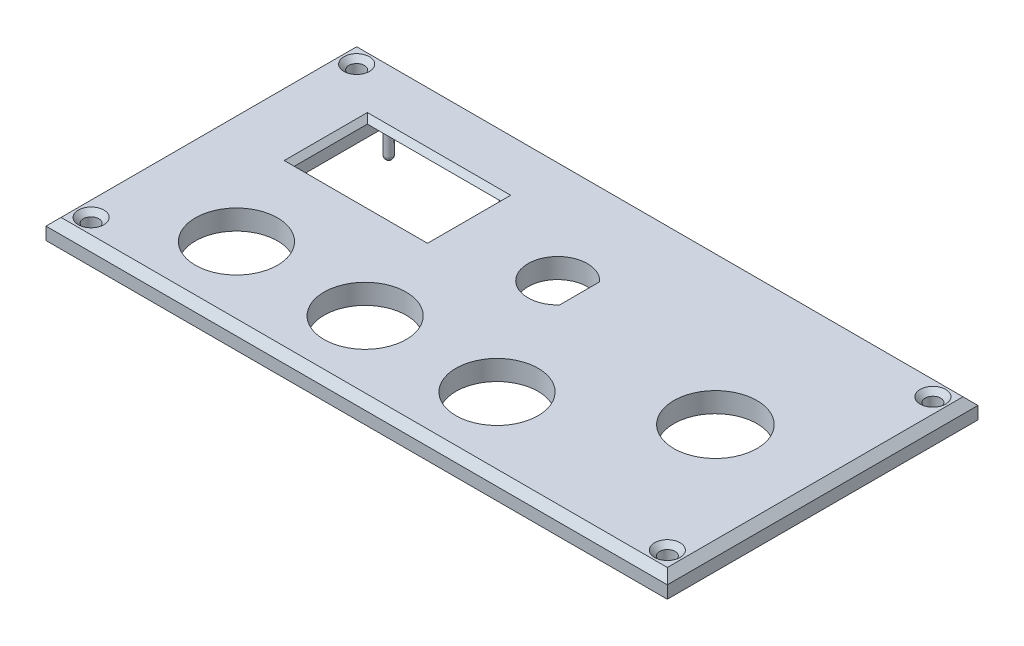
ISO-10303-21;
HEADER;
FILE_DESCRIPTION(('STEP AP214'),'2;1');
FILE_NAME('part.step','',(''),(''),'','','');
FILE_SCHEMA(('AUTOMOTIVE_DESIGN { 1 0 10303 214 1 1 1 1 }'));
ENDSEC;
DATA;
#1=APPLICATION_CONTEXT('core data for automotive mechanical design processes');
#2=APPLICATION_PROTOCOL_DEFINITION('international standard','automotive_design',2000,#1);
#3=PRODUCT_CONTEXT('',#1,'mechanical');
#4=PRODUCT('Part','Part','',(#3));
#5=PRODUCT_RELATED_PRODUCT_CATEGORY('part','',(#4));
#6=PRODUCT_DEFINITION_FORMATION('','',#4);
#7=PRODUCT_DEFINITION_CONTEXT('part definition',#1,'design');
#8=PRODUCT_DEFINITION('design','',#6,#7);
#9=PRODUCT_DEFINITION_SHAPE('','',#8);
#10=(LENGTH_UNIT() NAMED_UNIT(*) SI_UNIT(.MILLI.,.METRE.));
#11=(NAMED_UNIT(*) PLANE_ANGLE_UNIT() SI_UNIT($,.RADIAN.));
#12=(NAMED_UNIT(*) SI_UNIT($,.STERADIAN.) SOLID_ANGLE_UNIT());
#13=UNCERTAINTY_MEASURE_WITH_UNIT(LENGTH_MEASURE(1.E-05),#10,'distance_accuracy_value','');
#14=(GEOMETRIC_REPRESENTATION_CONTEXT(3) GLOBAL_UNCERTAINTY_ASSIGNED_CONTEXT((#13)) GLOBAL_UNIT_ASSIGNED_CONTEXT((#10,
#11,#12)) REPRESENTATION_CONTEXT('',''));
#15=CARTESIAN_POINT('',(0.,0.,0.));
#16=DIRECTION('',(0.,0.,1.));
#17=DIRECTION('',(1.,0.,0.));
#18=AXIS2_PLACEMENT_3D('',#15,#16,#17);
#19=CARTESIAN_POINT('',(62.,4.,-40.119282109088));
#20=DIRECTION('',(0.,-1.,0.));
#21=DIRECTION('',(0.,0.,-1.));
#22=AXIS2_PLACEMENT_3D('',#19,#20,#21);
#23=CYLINDRICAL_SURFACE('',#22,5.925);
#24=CARTESIAN_POINT('',(62.,0.,-40.119282109088));
#25=DIRECTION('',(0.,1.,0.));
#26=DIRECTION('',(0.,0.,1.));
#27=AXIS2_PLACEMENT_3D('',#24,#25,#26);
#28=CIRCLE('',#27,5.925);
#29=CARTESIAN_POINT('',(66.375,0.,-44.1149047138894));
#30=VERTEX_POINT('',#29);
#31=CARTESIAN_POINT('',(66.375,0.,-36.1236595042866));
#32=VERTEX_POINT('',#31);
#33=EDGE_CURVE('E293',#30,#32,#28,.T.);
#34=ORIENTED_EDGE('',*,*,#33,.F.);
#35=DIRECTION('',(0.,-1.,0.));
#36=VECTOR('',#35,1.);
#37=CARTESIAN_POINT('',(66.375,4.,-44.1149047138894));
#38=LINE('',#37,#36);
#39=CARTESIAN_POINT('',(66.375,4.,-44.1149047138894));
#40=VERTEX_POINT('',#39);
#41=EDGE_CURVE('E311',#40,#30,#38,.T.);
#42=ORIENTED_EDGE('',*,*,#41,.F.);
#43=CARTESIAN_POINT('',(62.,4.,-40.119282109088));
#44=DIRECTION('',(0.,1.,0.));
#45=DIRECTION('',(0.,0.,1.));
#46=AXIS2_PLACEMENT_3D('',#43,#44,#45);
#47=CIRCLE('',#46,5.925);
#48=CARTESIAN_POINT('',(66.375,4.,-36.1236595042866));
#49=VERTEX_POINT('',#48);
#50=EDGE_CURVE('E240',#40,#49,#47,.T.);
#51=ORIENTED_EDGE('',*,*,#50,.T.);
#52=DIRECTION('',(0.,-1.,0.));
#53=VECTOR('',#52,1.);
#54=CARTESIAN_POINT('',(66.375,4.,-36.1236595042866));
#55=LINE('',#54,#53);
#56=EDGE_CURVE('E308',#49,#32,#55,.T.);
#57=ORIENTED_EDGE('',*,*,#56,.T.);
#58=EDGE_LOOP('',(#34,#42,#51,#57));
#59=FACE_BOUND('',#58,.T.);
#60=ADVANCED_FACE('F41',(#59),#23,.F.);
#61=CARTESIAN_POINT('',(0.,4.,0.));
#62=DIRECTION('',(0.,0.,-1.));
#63=DIRECTION('',(-1.,0.,0.));
#64=AXIS2_PLACEMENT_3D('',#61,#62,#63);
#65=PLANE('',#64);
#66=DIRECTION('',(0.,-1.,0.));
#67=VECTOR('',#66,1.);
#68=CARTESIAN_POINT('',(124.,4.,0.));
#69=LINE('',#68,#67);
#70=CARTESIAN_POINT('',(124.,2.49999999999998,0.));
#71=VERTEX_POINT('',#70);
#72=CARTESIAN_POINT('',(124.,0.,0.));
#73=VERTEX_POINT('',#72);
#74=EDGE_CURVE('E312',#71,#73,#69,.T.);
#75=ORIENTED_EDGE('',*,*,#74,.F.);
#76=DIRECTION('',(-1.,0.,0.));
#77=VECTOR('',#76,1.);
#78=CARTESIAN_POINT('',(0.,2.49999999999998,0.));
#79=LINE('',#78,#77);
#80=CARTESIAN_POINT('',(0.,2.49999999999998,0.));
#81=VERTEX_POINT('',#80);
#82=EDGE_CURVE('E345',#71,#81,#79,.T.);
#83=ORIENTED_EDGE('',*,*,#82,.T.);
#84=DIRECTION('',(0.,-1.,0.));
#85=VECTOR('',#84,1.);
#86=CARTESIAN_POINT('',(0.,4.,0.));
#87=LINE('',#86,#85);
#88=CARTESIAN_POINT('',(0.,0.,0.));
#89=VERTEX_POINT('',#88);
#90=EDGE_CURVE('E255',#81,#89,#87,.T.);
#91=ORIENTED_EDGE('',*,*,#90,.T.);
#92=DIRECTION('',(1.,0.,0.));
#93=VECTOR('',#92,1.);
#94=CARTESIAN_POINT('',(0.,0.,0.));
#95=LINE('',#94,#93);
#96=EDGE_CURVE('E269',#89,#73,#95,.T.);
#97=ORIENTED_EDGE('',*,*,#96,.T.);
#98=EDGE_LOOP('',(#75,#83,#91,#97));
#99=FACE_BOUND('',#98,.T.);
#100=ADVANCED_FACE('F467',(#99),#65,.F.);
#101=CARTESIAN_POINT('',(124.,4.,0.));
#102=DIRECTION('',(-1.,0.,0.));
#103=DIRECTION('',(0.,0.,1.));
#104=AXIS2_PLACEMENT_3D('',#101,#102,#103);
#105=PLANE('',#104);
#106=DIRECTION('',(0.,-1.,0.));
#107=VECTOR('',#106,1.);
#108=CARTESIAN_POINT('',(124.,4.,-62.));
#109=LINE('',#108,#107);
#110=CARTESIAN_POINT('',(124.,2.49999999999998,-62.));
#111=VERTEX_POINT('',#110);
#112=CARTESIAN_POINT('',(124.,0.,-62.));
#113=VERTEX_POINT('',#112);
#114=EDGE_CURVE('E321',#111,#113,#109,.T.);
#115=ORIENTED_EDGE('',*,*,#114,.F.);
#116=DIRECTION('',(0.,0.,1.));
#117=VECTOR('',#116,1.);
#118=CARTESIAN_POINT('',(124.,2.49999999999998,0.));
#119=LINE('',#118,#117);
#120=EDGE_CURVE('E338',#111,#71,#119,.T.);
#121=ORIENTED_EDGE('',*,*,#120,.T.);
#122=ORIENTED_EDGE('',*,*,#74,.T.);
#123=DIRECTION('',(0.,0.,-1.));
#124=VECTOR('',#123,1.);
#125=CARTESIAN_POINT('',(124.,0.,0.));
#126=LINE('',#125,#124);
#127=EDGE_CURVE('E273',#73,#113,#126,.T.);
#128=ORIENTED_EDGE('',*,*,#127,.T.);
#129=EDGE_LOOP('',(#115,#121,#122,#128));
#130=FACE_BOUND('',#129,.T.);
#131=ADVANCED_FACE('F473',(#130),#105,.F.);
#132=CARTESIAN_POINT('',(0.,4.,-62.));
#133=DIRECTION('',(0.,0.,-1.));
#134=DIRECTION('',(-1.,0.,0.));
#135=AXIS2_PLACEMENT_3D('',#132,#133,#134);
#136=PLANE('',#135);
#137=DIRECTION('',(0.,-1.,0.));
#138=VECTOR('',#137,1.);
#139=CARTESIAN_POINT('',(0.,4.,-62.));
#140=LINE('',#139,#138);
#141=CARTESIAN_POINT('',(0.,2.49999999999998,-62.));
#142=VERTEX_POINT('',#141);
#143=CARTESIAN_POINT('',(0.,0.,-62.));
#144=VERTEX_POINT('',#143);
#145=EDGE_CURVE('E318',#142,#144,#140,.T.);
#146=ORIENTED_EDGE('',*,*,#145,.F.);
#147=DIRECTION('',(1.,0.,0.));
#148=VECTOR('',#147,1.);
#149=CARTESIAN_POINT('',(0.,2.49999999999998,-62.));
#150=LINE('',#149,#148);
#151=EDGE_CURVE('E342',#142,#111,#150,.T.);
#152=ORIENTED_EDGE('',*,*,#151,.T.);
#153=ORIENTED_EDGE('',*,*,#114,.T.);
#154=DIRECTION('',(1.,0.,0.));
#155=VECTOR('',#154,1.);
#156=CARTESIAN_POINT('',(0.,0.,-62.));
#157=LINE('',#156,#155);
#158=EDGE_CURVE('E277',#144,#113,#157,.T.);
#159=ORIENTED_EDGE('',*,*,#158,.F.);
#160=EDGE_LOOP('',(#146,#152,#153,#159));
#161=FACE_BOUND('',#160,.T.);
#162=ADVANCED_FACE('F494',(#161),#136,.T.);
#163=CARTESIAN_POINT('',(48.8465476147548,4.,-14.8395625050111));
#164=DIRECTION('',(0.,-1.,0.));
#165=DIRECTION('',(0.,0.,-1.));
#166=AXIS2_PLACEMENT_3D('',#163,#164,#165);
#167=CYLINDRICAL_SURFACE('',#166,8.2);
#168=CARTESIAN_POINT('',(48.8465476147548,4.,-14.8395625050111));
#169=DIRECTION('',(0.,1.,0.));
#170=DIRECTION('',(0.,0.,1.));
#171=AXIS2_PLACEMENT_3D('',#168,#169,#170);
#172=CIRCLE('',#171,8.2);
#173=CARTESIAN_POINT('',(48.8465476147548,4.,-6.63956250501106));
#174=VERTEX_POINT('',#173);
#175=EDGE_CURVE('E247',#174,#174,#172,.T.);
#176=ORIENTED_EDGE('',*,*,#175,.T.);
#177=EDGE_LOOP('',(#176));
#178=FACE_BOUND('',#177,.T.);
#179=CARTESIAN_POINT('',(48.8465476147548,0.,-14.8395625050111));
#180=DIRECTION('',(0.,1.,0.));
#181=DIRECTION('',(0.,0.,1.));
#182=AXIS2_PLACEMENT_3D('',#179,#180,#181);
#183=CIRCLE('',#182,8.2);
#184=CARTESIAN_POINT('',(48.8465476147548,0.,-6.63956250501106));
#185=VERTEX_POINT('',#184);
#186=EDGE_CURVE('E301',#185,#185,#183,.T.);
#187=ORIENTED_EDGE('',*,*,#186,.F.);
#188=EDGE_LOOP('',(#187));
#189=FACE_BOUND('',#188,.T.);
#190=ADVANCED_FACE('F497',(#178,#189),#167,.F.);
#191=CARTESIAN_POINT('',(66.375,4.,0.));
#192=DIRECTION('',(1.,0.,0.));
#193=DIRECTION('',(0.,0.,-1.));
#194=AXIS2_PLACEMENT_3D('',#191,#192,#193);
#195=PLANE('',#194);
#196=DIRECTION('',(0.,0.,1.));
#197=VECTOR('',#196,1.);
#198=CARTESIAN_POINT('',(66.375,0.,0.));
#199=LINE('',#198,#197);
#200=EDGE_CURVE('E297',#30,#32,#199,.T.);
#201=ORIENTED_EDGE('',*,*,#200,.T.);
#202=ORIENTED_EDGE('',*,*,#56,.F.);
#203=DIRECTION('',(0.,0.,1.));
#204=VECTOR('',#203,1.);
#205=CARTESIAN_POINT('',(66.375,4.,0.));
#206=LINE('',#205,#204);
#207=EDGE_CURVE('E244',#40,#49,#206,.T.);
#208=ORIENTED_EDGE('',*,*,#207,.F.);
#209=ORIENTED_EDGE('',*,*,#41,.T.);
#210=EDGE_LOOP('',(#201,#202,#208,#209));
#211=FACE_BOUND('',#210,.T.);
#212=ADVANCED_FACE('F479',(#211),#195,.F.);
#213=CARTESIAN_POINT('',(75.1710871778428,4.,-14.8395625050111));
#214=DIRECTION('',(0.,-1.,0.));
#215=DIRECTION('',(0.,0.,-1.));
#216=AXIS2_PLACEMENT_3D('',#213,#214,#215);
#217=CYLINDRICAL_SURFACE('',#216,8.2);
#218=CARTESIAN_POINT('',(75.1710871778428,4.,-14.8395625050111));
#219=DIRECTION('',(0.,1.,0.));
#220=DIRECTION('',(0.,0.,1.));
#221=AXIS2_PLACEMENT_3D('',#218,#219,#220);
#222=CIRCLE('',#221,8.2);
#223=CARTESIAN_POINT('',(75.1710871778428,4.,-6.63956250501106));
#224=VERTEX_POINT('',#223);
#225=EDGE_CURVE('E235',#224,#224,#222,.T.);
#226=ORIENTED_EDGE('',*,*,#225,.T.);
#227=EDGE_LOOP('',(#226));
#228=FACE_BOUND('',#227,.T.);
#229=CARTESIAN_POINT('',(75.1710871778428,0.,-14.8395625050111));
#230=DIRECTION('',(0.,1.,0.));
#231=DIRECTION('',(0.,0.,1.));
#232=AXIS2_PLACEMENT_3D('',#229,#230,#231);
#233=CIRCLE('',#232,8.2);
#234=CARTESIAN_POINT('',(75.1710871778428,0.,-6.63956250501106));
#235=VERTEX_POINT('',#234);
#236=EDGE_CURVE('E289',#235,#235,#233,.T.);
#237=ORIENTED_EDGE('',*,*,#236,.F.);
#238=EDGE_LOOP('',(#237));
#239=FACE_BOUND('',#238,.T.);
#240=ADVANCED_FACE('F481',(#228,#239),#217,.F.);
#241=CARTESIAN_POINT('',(102.593331931018,4.,-31.));
#242=DIRECTION('',(0.,-1.,0.));
#243=DIRECTION('',(0.,0.,-1.));
#244=AXIS2_PLACEMENT_3D('',#241,#242,#243);
#245=CYLINDRICAL_SURFACE('',#244,8.3);
#246=CARTESIAN_POINT('',(102.593331931018,4.,-31.));
#247=DIRECTION('',(0.,1.,0.));
#248=DIRECTION('',(0.,0.,1.));
#249=AXIS2_PLACEMENT_3D('',#246,#247,#248);
#250=CIRCLE('',#249,8.3);
#251=CARTESIAN_POINT('',(102.593331931018,4.,-22.7));
#252=VERTEX_POINT('',#251);
#253=EDGE_CURVE('E231',#252,#252,#250,.T.);
#254=ORIENTED_EDGE('',*,*,#253,.T.);
#255=EDGE_LOOP('',(#254));
#256=FACE_BOUND('',#255,.T.);
#257=CARTESIAN_POINT('',(102.593331931018,0.,-31.));
#258=DIRECTION('',(0.,1.,0.));
#259=DIRECTION('',(0.,0.,1.));
#260=AXIS2_PLACEMENT_3D('',#257,#258,#259);
#261=CIRCLE('',#260,8.3);
#262=CARTESIAN_POINT('',(102.593331931018,0.,-22.7));
#263=VERTEX_POINT('',#262);
#264=EDGE_CURVE('E285',#263,#263,#261,.T.);
#265=ORIENTED_EDGE('',*,*,#264,.F.);
#266=EDGE_LOOP('',(#265));
#267=FACE_BOUND('',#266,.T.);
#268=ADVANCED_FACE('F484',(#256,#267),#245,.F.);
#269=CARTESIAN_POINT('',(0.,4.,0.));
#270=DIRECTION('',(-1.,0.,0.));
#271=DIRECTION('',(0.,0.,1.));
#272=AXIS2_PLACEMENT_3D('',#269,#270,#271);
#273=PLANE('',#272);
#274=ORIENTED_EDGE('',*,*,#90,.F.);
#275=DIRECTION('',(0.,0.,-1.));
#276=VECTOR('',#275,1.);
#277=CARTESIAN_POINT('',(0.,2.49999999999998,0.));
#278=LINE('',#277,#276);
#279=EDGE_CURVE('E348',#81,#142,#278,.T.);
#280=ORIENTED_EDGE('',*,*,#279,.T.);
#281=ORIENTED_EDGE('',*,*,#145,.T.);
#282=DIRECTION('',(0.,0.,-1.));
#283=VECTOR('',#282,1.);
#284=CARTESIAN_POINT('',(0.,0.,0.));
#285=LINE('',#284,#283);
#286=EDGE_CURVE('E281',#89,#144,#285,.T.);
#287=ORIENTED_EDGE('',*,*,#286,.F.);
#288=EDGE_LOOP('',(#274,#280,#281,#287));
#289=FACE_BOUND('',#288,.T.);
#290=ADVANCED_FACE('F488',(#289),#273,.T.);
#291=CARTESIAN_POINT('',(4.5,4.,-57.5));
#292=DIRECTION('',(0.,-1.,0.));
#293=DIRECTION('',(0.,0.,-1.));
#294=AXIS2_PLACEMENT_3D('',#291,#292,#293);
#295=CYLINDRICAL_SURFACE('',#294,1.55);
#296=CARTESIAN_POINT('',(4.5,2.99999999999996,-57.5));
#297=DIRECTION('',(0.,1.,0.));
#298=DIRECTION('',(0.,0.,1.));
#299=AXIS2_PLACEMENT_3D('',#296,#297,#298);
#300=CIRCLE('',#299,1.55);
#301=CARTESIAN_POINT('',(4.5,2.99999999999996,-55.95));
#302=VERTEX_POINT('',#301);
#303=EDGE_CURVE('E399',#302,#302,#300,.T.);
#304=ORIENTED_EDGE('',*,*,#303,.T.);
#305=EDGE_LOOP('',(#304));
#306=FACE_BOUND('',#305,.T.);
#307=CARTESIAN_POINT('',(4.5,0.,-57.5));
#308=DIRECTION('',(0.,1.,0.));
#309=DIRECTION('',(0.,0.,1.));
#310=AXIS2_PLACEMENT_3D('',#307,#308,#309);
#311=CIRCLE('',#310,1.55);
#312=CARTESIAN_POINT('',(4.5,0.,-55.95));
#313=VERTEX_POINT('',#312);
#314=EDGE_CURVE('E265',#313,#313,#311,.T.);
#315=ORIENTED_EDGE('',*,*,#314,.F.);
#316=EDGE_LOOP('',(#315));
#317=FACE_BOUND('',#316,.T.);
#318=ADVANCED_FACE('F492',(#306,#317),#295,.F.);
#319=CARTESIAN_POINT('',(119.5,4.,-4.5));
#320=DIRECTION('',(0.,-1.,0.));
#321=DIRECTION('',(0.,0.,-1.));
#322=AXIS2_PLACEMENT_3D('',#319,#320,#321);
#323=CYLINDRICAL_SURFACE('',#322,1.54999999999999);
#324=CARTESIAN_POINT('',(119.5,2.99999999999999,-4.5));
#325=DIRECTION('',(0.,1.,0.));
#326=DIRECTION('',(0.,0.,1.));
#327=AXIS2_PLACEMENT_3D('',#324,#325,#326);
#328=CIRCLE('',#327,1.54999999999999);
#329=CARTESIAN_POINT('',(119.5,2.99999999999999,-2.95000000000001));
#330=VERTEX_POINT('',#329);
#331=EDGE_CURVE('E395',#330,#330,#328,.T.);
#332=ORIENTED_EDGE('',*,*,#331,.T.);
#333=EDGE_LOOP('',(#332));
#334=FACE_BOUND('',#333,.T.);
#335=CARTESIAN_POINT('',(119.5,0.,-4.5));
#336=DIRECTION('',(0.,1.,0.));
#337=DIRECTION('',(0.,0.,1.));
#338=AXIS2_PLACEMENT_3D('',#335,#336,#337);
#339=CIRCLE('',#338,1.54999999999999);
#340=CARTESIAN_POINT('',(119.5,0.,-2.95000000000001));
#341=VERTEX_POINT('',#340);
#342=EDGE_CURVE('E260',#341,#341,#339,.T.);
#343=ORIENTED_EDGE('',*,*,#342,.F.);
#344=EDGE_LOOP('',(#343));
#345=FACE_BOUND('',#344,.T.);
#346=ADVANCED_FACE('F504',(#334,#345),#323,.F.);
#347=CARTESIAN_POINT('',(119.5,4.,-57.5));
#348=DIRECTION('',(0.,-1.,0.));
#349=DIRECTION('',(0.,0.,-1.));
#350=AXIS2_PLACEMENT_3D('',#347,#348,#349);
#351=CYLINDRICAL_SURFACE('',#350,1.54999999999999);
#352=CARTESIAN_POINT('',(119.5,1.00000000000003,-57.5));
#353=DIRECTION('',(0.,1.,0.));
#354=DIRECTION('',(0.,0.,1.));
#355=AXIS2_PLACEMENT_3D('',#352,#353,#354);
#356=CIRCLE('',#355,1.54999999999999);
#357=CARTESIAN_POINT('',(119.5,1.00000000000003,-55.95));
#358=VERTEX_POINT('',#357);
#359=EDGE_CURVE('E371',#358,#358,#356,.F.);
#360=ORIENTED_EDGE('',*,*,#359,.T.);
#361=EDGE_LOOP('',(#360));
#362=FACE_BOUND('',#361,.T.);
#363=CARTESIAN_POINT('',(119.5,2.99999999999999,-57.5));
#364=DIRECTION('',(0.,1.,0.));
#365=DIRECTION('',(0.,0.,1.));
#366=AXIS2_PLACEMENT_3D('',#363,#364,#365);
#367=CIRCLE('',#366,1.54999999999999);
#368=CARTESIAN_POINT('',(119.5,2.99999999999999,-55.95));
#369=VERTEX_POINT('',#368);
#370=EDGE_CURVE('E367',#369,#369,#367,.T.);
#371=ORIENTED_EDGE('',*,*,#370,.T.);
#372=EDGE_LOOP('',(#371));
#373=FACE_BOUND('',#372,.T.);
#374=ADVANCED_FACE('F508',(#362,#373),#351,.F.);
#375=CARTESIAN_POINT('',(4.50000000000001,4.,-4.5));
#376=DIRECTION('',(0.,-1.,0.));
#377=DIRECTION('',(0.,0.,-1.));
#378=AXIS2_PLACEMENT_3D('',#375,#376,#377);
#379=CYLINDRICAL_SURFACE('',#378,1.55);
#380=CARTESIAN_POINT('',(4.50000000000001,3.,-4.5));
#381=DIRECTION('',(0.,1.,0.));
#382=DIRECTION('',(0.,0.,1.));
#383=AXIS2_PLACEMENT_3D('',#380,#381,#382);
#384=CIRCLE('',#383,1.55);
#385=CARTESIAN_POINT('',(4.50000000000001,3.,-2.95));
#386=VERTEX_POINT('',#385);
#387=EDGE_CURVE('E391',#386,#386,#384,.T.);
#388=ORIENTED_EDGE('',*,*,#387,.T.);
#389=EDGE_LOOP('',(#388));
#390=FACE_BOUND('',#389,.T.);
#391=CARTESIAN_POINT('',(4.50000000000001,0.,-4.5));
#392=DIRECTION('',(0.,1.,0.));
#393=DIRECTION('',(0.,0.,1.));
#394=AXIS2_PLACEMENT_3D('',#391,#392,#393);
#395=CIRCLE('',#394,1.55);
#396=CARTESIAN_POINT('',(4.50000000000001,0.,-2.95));
#397=VERTEX_POINT('',#396);
#398=EDGE_CURVE('E256',#397,#397,#395,.T.);
#399=ORIENTED_EDGE('',*,*,#398,.F.);
#400=EDGE_LOOP('',(#399));
#401=FACE_BOUND('',#400,.T.);
#402=ADVANCED_FACE('F512',(#390,#401),#379,.F.);
#403=CARTESIAN_POINT('',(23.1710871778428,4.,-14.8395625050111));
#404=DIRECTION('',(0.,-1.,0.));
#405=DIRECTION('',(0.,0.,-1.));
#406=AXIS2_PLACEMENT_3D('',#403,#404,#405);
#407=CYLINDRICAL_SURFACE('',#406,8.2);
#408=CARTESIAN_POINT('',(23.1710871778428,4.,-14.8395625050111));
#409=DIRECTION('',(0.,1.,0.));
#410=DIRECTION('',(0.,0.,1.));
#411=AXIS2_PLACEMENT_3D('',#408,#409,#410);
#412=CIRCLE('',#411,8.2);
#413=CARTESIAN_POINT('',(23.1710871778428,4.,-6.63956250501106));
#414=VERTEX_POINT('',#413);
#415=EDGE_CURVE('E251',#414,#414,#412,.T.);
#416=ORIENTED_EDGE('',*,*,#415,.T.);
#417=EDGE_LOOP('',(#416));
#418=FACE_BOUND('',#417,.T.);
#419=CARTESIAN_POINT('',(23.1710871778428,0.,-14.8395625050111));
#420=DIRECTION('',(0.,1.,0.));
#421=DIRECTION('',(0.,0.,1.));
#422=AXIS2_PLACEMENT_3D('',#419,#420,#421);
#423=CIRCLE('',#422,8.2);
#424=CARTESIAN_POINT('',(23.1710871778428,0.,-6.63956250501106));
#425=VERTEX_POINT('',#424);
#426=EDGE_CURVE('E236',#425,#425,#423,.T.);
#427=ORIENTED_EDGE('',*,*,#426,.F.);
#428=EDGE_LOOP('',(#427));
#429=FACE_BOUND('',#428,.T.);
#430=ADVANCED_FACE('F516',(#418,#429),#407,.F.);
#431=CARTESIAN_POINT('',(0.,4.,0.));
#432=DIRECTION('',(0.,1.,0.));
#433=DIRECTION('',(0.,0.,1.));
#434=AXIS2_PLACEMENT_3D('',#431,#432,#433);
#435=PLANE('',#434);
#436=DIRECTION('',(0.,0.,1.));
#437=VECTOR('',#436,1.);
#438=CARTESIAN_POINT('',(42.5397433872665,4.,-34.5974092100342));
#439=LINE('',#438,#437);
#440=CARTESIAN_POINT('',(42.5397433872665,4.,-50.1974092100343));
#441=VERTEX_POINT('',#440);
#442=CARTESIAN_POINT('',(42.5397433872665,4.,-33.5974092100342));
#443=VERTEX_POINT('',#442);
#444=EDGE_CURVE('E51',#441,#443,#439,.T.);
#445=ORIENTED_EDGE('',*,*,#444,.T.);
#446=DIRECTION('',(-1.,0.,0.));
#447=VECTOR('',#446,1.);
#448=CARTESIAN_POINT('',(0.,4.,-33.5974092100342));
#449=LINE('',#448,#447);
#450=CARTESIAN_POINT('',(13.9397433872664,4.,-33.5974092100342));
#451=VERTEX_POINT('',#450);
#452=EDGE_CURVE('E11',#443,#451,#449,.T.);
#453=ORIENTED_EDGE('',*,*,#452,.T.);
#454=DIRECTION('',(0.,0.,-1.));
#455=VECTOR('',#454,1.);
#456=CARTESIAN_POINT('',(13.9397433872664,4.,0.));
#457=LINE('',#456,#455);
#458=CARTESIAN_POINT('',(13.9397433872664,4.,-50.1974092100343));
#459=VERTEX_POINT('',#458);
#460=EDGE_CURVE('E422',#451,#459,#457,.T.);
#461=ORIENTED_EDGE('',*,*,#460,.T.);
#462=DIRECTION('',(1.,0.,0.));
#463=VECTOR('',#462,1.);
#464=CARTESIAN_POINT('',(41.5397433872664,4.,-50.1974092100343));
#465=LINE('',#464,#463);
#466=EDGE_CURVE('E419',#459,#441,#465,.T.);
#467=ORIENTED_EDGE('',*,*,#466,.T.);
#468=EDGE_LOOP('',(#445,#453,#461,#467));
#469=FACE_BOUND('',#468,.T.);
#470=CARTESIAN_POINT('',(119.5,4.,-57.5));
#471=DIRECTION('',(0.,1.,0.));
#472=DIRECTION('',(0.,0.,1.));
#473=AXIS2_PLACEMENT_3D('',#470,#471,#472);
#474=CIRCLE('',#473,2.55000000000001);
#475=CARTESIAN_POINT('',(119.5,4.,-54.95));
#476=VERTEX_POINT('',#475);
#477=EDGE_CURVE('E387',#476,#476,#474,.F.);
#478=ORIENTED_EDGE('',*,*,#477,.T.);
#479=EDGE_LOOP('',(#478));
#480=FACE_BOUND('',#479,.T.);
#481=CARTESIAN_POINT('',(4.50000000000001,4.,-4.5));
#482=DIRECTION('',(0.,1.,0.));
#483=DIRECTION('',(0.,0.,1.));
#484=AXIS2_PLACEMENT_3D('',#481,#482,#483);
#485=CIRCLE('',#484,2.55000000000001);
#486=CARTESIAN_POINT('',(4.50000000000001,4.,-1.94999999999999));
#487=VERTEX_POINT('',#486);
#488=EDGE_CURVE('E383',#487,#487,#485,.F.);
#489=ORIENTED_EDGE('',*,*,#488,.T.);
#490=EDGE_LOOP('',(#489));
#491=FACE_BOUND('',#490,.T.);
#492=CARTESIAN_POINT('',(119.5,4.,-4.5));
#493=DIRECTION('',(0.,1.,0.));
#494=DIRECTION('',(0.,0.,1.));
#495=AXIS2_PLACEMENT_3D('',#492,#493,#494);
#496=CIRCLE('',#495,2.55000000000001);
#497=CARTESIAN_POINT('',(119.5,4.,-1.94999999999999));
#498=VERTEX_POINT('',#497);
#499=EDGE_CURVE('E379',#498,#498,#496,.F.);
#500=ORIENTED_EDGE('',*,*,#499,.T.);
#501=EDGE_LOOP('',(#500));
#502=FACE_BOUND('',#501,.T.);
#503=CARTESIAN_POINT('',(4.5,4.,-57.5));
#504=DIRECTION('',(0.,1.,0.));
#505=DIRECTION('',(0.,0.,1.));
#506=AXIS2_PLACEMENT_3D('',#503,#504,#505);
#507=CIRCLE('',#506,2.55000000000005);
#508=CARTESIAN_POINT('',(4.5,4.,-54.95));
#509=VERTEX_POINT('',#508);
#510=EDGE_CURVE('E375',#509,#509,#507,.F.);
#511=ORIENTED_EDGE('',*,*,#510,.T.);
#512=EDGE_LOOP('',(#511));
#513=FACE_BOUND('',#512,.T.);
#514=DIRECTION('',(1.,0.,0.));
#515=VECTOR('',#514,1.);
#516=CARTESIAN_POINT('',(124.,4.,-1.50000000000002));
#517=LINE('',#516,#515);
#518=CARTESIAN_POINT('',(1.50000000000002,4.,-1.50000000000002));
#519=VERTEX_POINT('',#518);
#520=CARTESIAN_POINT('',(122.5,4.,-1.50000000000002));
#521=VERTEX_POINT('',#520);
#522=EDGE_CURVE('E328',#519,#521,#517,.T.);
#523=ORIENTED_EDGE('',*,*,#522,.T.);
#524=DIRECTION('',(0.,0.,-1.));
#525=VECTOR('',#524,1.);
#526=CARTESIAN_POINT('',(122.5,4.,-62.));
#527=LINE('',#526,#525);
#528=CARTESIAN_POINT('',(122.5,4.,-60.5));
#529=VERTEX_POINT('',#528);
#530=EDGE_CURVE('E334',#521,#529,#527,.T.);
#531=ORIENTED_EDGE('',*,*,#530,.T.);
#532=DIRECTION('',(-1.,0.,0.));
#533=VECTOR('',#532,1.);
#534=CARTESIAN_POINT('',(0.,4.,-60.5));
#535=LINE('',#534,#533);
#536=CARTESIAN_POINT('',(1.50000000000002,4.,-60.5));
#537=VERTEX_POINT('',#536);
#538=EDGE_CURVE('E331',#529,#537,#535,.T.);
#539=ORIENTED_EDGE('',*,*,#538,.T.);
#540=DIRECTION('',(0.,0.,1.));
#541=VECTOR('',#540,1.);
#542=CARTESIAN_POINT('',(1.50000000000002,4.,0.));
#543=LINE('',#542,#541);
#544=EDGE_CURVE('E315',#537,#519,#543,.T.);
#545=ORIENTED_EDGE('',*,*,#544,.T.);
#546=EDGE_LOOP('',(#523,#531,#539,#545));
#547=FACE_BOUND('',#546,.T.);
#548=ORIENTED_EDGE('',*,*,#253,.F.);
#549=EDGE_LOOP('',(#548));
#550=FACE_BOUND('',#549,.T.);
#551=ORIENTED_EDGE('',*,*,#225,.F.);
#552=EDGE_LOOP('',(#551));
#553=FACE_BOUND('',#552,.T.);
#554=ORIENTED_EDGE('',*,*,#50,.F.);
#555=ORIENTED_EDGE('',*,*,#207,.T.);
#556=EDGE_LOOP('',(#554,#555));
#557=FACE_BOUND('',#556,.T.);
#558=ORIENTED_EDGE('',*,*,#175,.F.);
#559=EDGE_LOOP('',(#558));
#560=FACE_BOUND('',#559,.T.);
#561=ORIENTED_EDGE('',*,*,#415,.F.);
#562=EDGE_LOOP('',(#561));
#563=FACE_BOUND('',#562,.T.);
#564=ADVANCED_FACE('F444',(#469,#480,#491,#502,#513,#547,#550,#553,#557,#560,#563),#435,.T.);
#565=CARTESIAN_POINT('',(0.,0.,0.));
#566=DIRECTION('',(0.,1.,0.));
#567=DIRECTION('',(0.,0.,1.));
#568=AXIS2_PLACEMENT_3D('',#565,#566,#567);
#569=PLANE('',#568);
#570=DIRECTION('',(1.,0.,0.));
#571=VECTOR('',#570,1.);
#572=CARTESIAN_POINT('',(0.,0.,-25.4474092100342));
#573=LINE('',#572,#571);
#574=CARTESIAN_POINT('',(14.2397433872664,0.,-25.4474092100342));
#575=VERTEX_POINT('',#574);
#576=CARTESIAN_POINT('',(42.2397433872664,0.,-25.4474092100342));
#577=VERTEX_POINT('',#576);
#578=EDGE_CURVE('E218',#575,#577,#573,.T.);
#579=ORIENTED_EDGE('',*,*,#578,.T.);
#580=DIRECTION('',(0.,0.,1.));
#581=VECTOR('',#580,1.);
#582=CARTESIAN_POINT('',(42.2397433872664,0.,0.));
#583=LINE('',#582,#581);
#584=CARTESIAN_POINT('',(42.2397433872664,0.,-53.7974092100342));
#585=VERTEX_POINT('',#584);
#586=EDGE_CURVE('E209',#585,#577,#583,.T.);
#587=ORIENTED_EDGE('',*,*,#586,.F.);
#588=DIRECTION('',(1.,0.,0.));
#589=VECTOR('',#588,1.);
#590=CARTESIAN_POINT('',(0.,0.,-53.7974092100342));
#591=LINE('',#590,#589);
#592=CARTESIAN_POINT('',(14.2397433872664,0.,-53.7974092100342));
#593=VERTEX_POINT('',#592);
#594=EDGE_CURVE('E163',#593,#585,#591,.T.);
#595=ORIENTED_EDGE('',*,*,#594,.F.);
#596=DIRECTION('',(0.,0.,1.));
#597=VECTOR('',#596,1.);
#598=CARTESIAN_POINT('',(14.2397433872665,0.,0.));
#599=LINE('',#598,#597);
#600=EDGE_CURVE('E214',#593,#575,#599,.T.);
#601=ORIENTED_EDGE('',*,*,#600,.T.);
#602=EDGE_LOOP('',(#579,#587,#595,#601));
#603=FACE_BOUND('',#602,.T.);
#604=CARTESIAN_POINT('',(119.5,0.,-57.5));
#605=DIRECTION('',(0.,1.,0.));
#606=DIRECTION('',(0.,0.,1.));
#607=AXIS2_PLACEMENT_3D('',#604,#605,#606);
#608=CIRCLE('',#607,2.55000000000001);
#609=CARTESIAN_POINT('',(119.5,0.,-54.95));
#610=VERTEX_POINT('',#609);
#611=EDGE_CURVE('E351',#610,#610,#608,.T.);
#612=ORIENTED_EDGE('',*,*,#611,.T.);
#613=EDGE_LOOP('',(#612));
#614=FACE_BOUND('',#613,.T.);
#615=ORIENTED_EDGE('',*,*,#398,.T.);
#616=EDGE_LOOP('',(#615));
#617=FACE_BOUND('',#616,.T.);
#618=ORIENTED_EDGE('',*,*,#342,.T.);
#619=EDGE_LOOP('',(#618));
#620=FACE_BOUND('',#619,.T.);
#621=ORIENTED_EDGE('',*,*,#314,.T.);
#622=EDGE_LOOP('',(#621));
#623=FACE_BOUND('',#622,.T.);
#624=ORIENTED_EDGE('',*,*,#96,.F.);
#625=ORIENTED_EDGE('',*,*,#286,.T.);
#626=ORIENTED_EDGE('',*,*,#158,.T.);
#627=ORIENTED_EDGE('',*,*,#127,.F.);
#628=EDGE_LOOP('',(#624,#625,#626,#627));
#629=FACE_BOUND('',#628,.T.);
#630=ORIENTED_EDGE('',*,*,#264,.T.);
#631=EDGE_LOOP('',(#630));
#632=FACE_BOUND('',#631,.T.);
#633=ORIENTED_EDGE('',*,*,#236,.T.);
#634=EDGE_LOOP('',(#633));
#635=FACE_BOUND('',#634,.T.);
#636=ORIENTED_EDGE('',*,*,#33,.T.);
#637=ORIENTED_EDGE('',*,*,#200,.F.);
#638=EDGE_LOOP('',(#636,#637));
#639=FACE_BOUND('',#638,.T.);
#640=ORIENTED_EDGE('',*,*,#186,.T.);
#641=EDGE_LOOP('',(#640));
#642=FACE_BOUND('',#641,.T.);
#643=ORIENTED_EDGE('',*,*,#426,.T.);
#644=EDGE_LOOP('',(#643));
#645=FACE_BOUND('',#644,.T.);
#646=ADVANCED_FACE('F534',(#603,#614,#617,#620,#623,#629,#632,#635,#639,#642,#645),#569,.F.);
#647=CARTESIAN_POINT('',(0.,2.49999999999998,0.));
#648=DIRECTION('',(0.707106781186547,-0.707106781186547,0.));
#649=DIRECTION('',(0.,0.,-1.));
#650=AXIS2_PLACEMENT_3D('',#647,#648,#649);
#651=PLANE('',#650);
#652=DIRECTION('',(-0.577350269189626,-0.577350269189626,-0.577350269189626));
#653=VECTOR('',#652,1.);
#654=CARTESIAN_POINT('',(20.6666666666667,23.1666666666667,-41.3333333333333));
#655=LINE('',#654,#653);
#656=EDGE_CURVE('E357',#142,#537,#655,.F.);
#657=ORIENTED_EDGE('',*,*,#656,.F.);
#658=ORIENTED_EDGE('',*,*,#279,.F.);
#659=DIRECTION('',(-0.577350269189626,-0.577350269189626,0.577350269189626));
#660=VECTOR('',#659,1.);
#661=CARTESIAN_POINT('',(0.,2.49999999999998,0.));
#662=LINE('',#661,#660);
#663=EDGE_CURVE('E261',#519,#81,#662,.T.);
#664=ORIENTED_EDGE('',*,*,#663,.F.);
#665=ORIENTED_EDGE('',*,*,#544,.F.);
#666=EDGE_LOOP('',(#657,#658,#664,#665));
#667=FACE_BOUND('',#666,.T.);
#668=ADVANCED_FACE('F530',(#667),#651,.F.);
#669=CARTESIAN_POINT('',(0.,4.,-1.50000000000002));
#670=DIRECTION('',(0.,0.707106781186547,0.707106781186547));
#671=DIRECTION('',(-1.,0.,0.));
#672=AXIS2_PLACEMENT_3D('',#669,#670,#671);
#673=PLANE('',#672);
#674=ORIENTED_EDGE('',*,*,#663,.T.);
#675=ORIENTED_EDGE('',*,*,#82,.F.);
#676=DIRECTION('',(-0.577350269189626,0.577350269189626,-0.577350269189626));
#677=VECTOR('',#676,1.);
#678=CARTESIAN_POINT('',(81.6666666666667,44.8333333333333,-42.3333333333333));
#679=LINE('',#678,#677);
#680=EDGE_CURVE('E354',#521,#71,#679,.F.);
#681=ORIENTED_EDGE('',*,*,#680,.F.);
#682=ORIENTED_EDGE('',*,*,#522,.F.);
#683=EDGE_LOOP('',(#674,#675,#681,#682));
#684=FACE_BOUND('',#683,.T.);
#685=ADVANCED_FACE('F526',(#684),#673,.T.);
#686=CARTESIAN_POINT('',(0.,2.49999999999998,-62.));
#687=DIRECTION('',(0.,-0.707106781186547,0.707106781186547));
#688=DIRECTION('',(1.,0.,0.));
#689=AXIS2_PLACEMENT_3D('',#686,#687,#688);
#690=PLANE('',#689);
#691=ORIENTED_EDGE('',*,*,#656,.T.);
#692=ORIENTED_EDGE('',*,*,#538,.F.);
#693=DIRECTION('',(-0.577350269189626,0.577350269189626,0.577350269189626));
#694=VECTOR('',#693,1.);
#695=CARTESIAN_POINT('',(82.6666666666667,43.8333333333333,-20.6666666666667));
#696=LINE('',#695,#694);
#697=EDGE_CURVE('E167',#111,#529,#696,.T.);
#698=ORIENTED_EDGE('',*,*,#697,.F.);
#699=ORIENTED_EDGE('',*,*,#151,.F.);
#700=EDGE_LOOP('',(#691,#692,#698,#699));
#701=FACE_BOUND('',#700,.T.);
#702=ADVANCED_FACE('F522',(#701),#690,.F.);
#703=CARTESIAN_POINT('',(122.5,4.,0.));
#704=DIRECTION('',(0.707106781186547,0.707106781186547,0.));
#705=DIRECTION('',(0.,0.,1.));
#706=AXIS2_PLACEMENT_3D('',#703,#704,#705);
#707=PLANE('',#706);
#708=ORIENTED_EDGE('',*,*,#680,.T.);
#709=ORIENTED_EDGE('',*,*,#120,.F.);
#710=ORIENTED_EDGE('',*,*,#697,.T.);
#711=ORIENTED_EDGE('',*,*,#530,.F.);
#712=EDGE_LOOP('',(#708,#709,#710,#711));
#713=FACE_BOUND('',#712,.T.);
#714=ADVANCED_FACE('F518',(#713),#707,.T.);
#715=CARTESIAN_POINT('',(119.5,0.,-57.5));
#716=DIRECTION('',(0.,-1.,0.));
#717=DIRECTION('',(0.,0.,-1.));
#718=AXIS2_PLACEMENT_3D('',#715,#716,#717);
#719=CONICAL_SURFACE('',#718,2.55000000000001,0.785398163397443);
#720=ORIENTED_EDGE('',*,*,#359,.F.);
#721=EDGE_LOOP('',(#720));
#722=FACE_BOUND('',#721,.T.);
#723=ORIENTED_EDGE('',*,*,#611,.F.);
#724=EDGE_LOOP('',(#723));
#725=FACE_BOUND('',#724,.T.);
#726=ADVANCED_FACE('F521',(#722,#725),#719,.F.);
#727=CARTESIAN_POINT('',(119.5,2.99999999999999,-57.5));
#728=DIRECTION('',(0.,1.,0.));
#729=DIRECTION('',(0.,0.,1.));
#730=AXIS2_PLACEMENT_3D('',#727,#728,#729);
#731=CONICAL_SURFACE('',#730,1.54999999999999,0.785398163397453);
#732=ORIENTED_EDGE('',*,*,#477,.F.);
#733=EDGE_LOOP('',(#732));
#734=FACE_BOUND('',#733,.T.);
#735=ORIENTED_EDGE('',*,*,#370,.F.);
#736=EDGE_LOOP('',(#735));
#737=FACE_BOUND('',#736,.T.);
#738=ADVANCED_FACE('F538',(#734,#737),#731,.F.);
#739=CARTESIAN_POINT('',(4.50000000000001,3.,-4.5));
#740=DIRECTION('',(0.,1.,0.));
#741=DIRECTION('',(0.,0.,1.));
#742=AXIS2_PLACEMENT_3D('',#739,#740,#741);
#743=CONICAL_SURFACE('',#742,1.55,0.785398163397453);
#744=ORIENTED_EDGE('',*,*,#488,.F.);
#745=EDGE_LOOP('',(#744));
#746=FACE_BOUND('',#745,.T.);
#747=ORIENTED_EDGE('',*,*,#387,.F.);
#748=EDGE_LOOP('',(#747));
#749=FACE_BOUND('',#748,.T.);
#750=ADVANCED_FACE('F542',(#746,#749),#743,.F.);
#751=CARTESIAN_POINT('',(119.5,2.99999999999999,-4.5));
#752=DIRECTION('',(0.,1.,0.));
#753=DIRECTION('',(0.,0.,1.));
#754=AXIS2_PLACEMENT_3D('',#751,#752,#753);
#755=CONICAL_SURFACE('',#754,1.54999999999999,0.785398163397453);
#756=ORIENTED_EDGE('',*,*,#499,.F.);
#757=EDGE_LOOP('',(#756));
#758=FACE_BOUND('',#757,.T.);
#759=ORIENTED_EDGE('',*,*,#331,.F.);
#760=EDGE_LOOP('',(#759));
#761=FACE_BOUND('',#760,.T.);
#762=ADVANCED_FACE('F546',(#758,#761),#755,.F.);
#763=CARTESIAN_POINT('',(4.5,2.99999999999996,-57.5));
#764=DIRECTION('',(0.,1.,0.));
#765=DIRECTION('',(0.,0.,1.));
#766=AXIS2_PLACEMENT_3D('',#763,#764,#765);
#767=CONICAL_SURFACE('',#766,1.55,0.785398163397452);
#768=ORIENTED_EDGE('',*,*,#510,.F.);
#769=EDGE_LOOP('',(#768));
#770=FACE_BOUND('',#769,.T.);
#771=ORIENTED_EDGE('',*,*,#303,.F.);
#772=EDGE_LOOP('',(#771));
#773=FACE_BOUND('',#772,.T.);
#774=ADVANCED_FACE('F550',(#770,#773),#767,.F.);
#775=CARTESIAN_POINT('',(42.2397433872664,3.,0.));
#776=DIRECTION('',(1.,0.,0.));
#777=DIRECTION('',(0.,0.,-1.));
#778=AXIS2_PLACEMENT_3D('',#775,#776,#777);
#779=PLANE('',#778);
#780=ORIENTED_EDGE('',*,*,#586,.T.);
#781=DIRECTION('',(0.,-1.,0.));
#782=VECTOR('',#781,1.);
#783=CARTESIAN_POINT('',(42.2397433872664,3.,-25.4474092100342));
#784=LINE('',#783,#782);
#785=CARTESIAN_POINT('',(42.2397433872664,3.,-25.4474092100342));
#786=VERTEX_POINT('',#785);
#787=EDGE_CURVE('E175',#786,#577,#784,.T.);
#788=ORIENTED_EDGE('',*,*,#787,.F.);
#789=DIRECTION('',(0.,0.,1.));
#790=VECTOR('',#789,1.);
#791=CARTESIAN_POINT('',(42.2397433872664,3.,0.));
#792=LINE('',#791,#790);
#793=CARTESIAN_POINT('',(42.2397433872664,3.,-53.7974092100342));
#794=VERTEX_POINT('',#793);
#795=EDGE_CURVE('E172',#794,#786,#792,.T.);
#796=ORIENTED_EDGE('',*,*,#795,.F.);
#797=DIRECTION('',(0.,-1.,0.));
#798=VECTOR('',#797,1.);
#799=CARTESIAN_POINT('',(42.2397433872664,3.,-53.7974092100342));
#800=LINE('',#799,#798);
#801=EDGE_CURVE('E157',#794,#585,#800,.T.);
#802=ORIENTED_EDGE('',*,*,#801,.T.);
#803=EDGE_LOOP('',(#780,#788,#796,#802));
#804=FACE_BOUND('',#803,.T.);
#805=ADVANCED_FACE('F173',(#804),#779,.F.);
#806=CARTESIAN_POINT('',(0.,3.,-53.7974092100342));
#807=DIRECTION('',(0.,0.,-1.));
#808=DIRECTION('',(-1.,0.,0.));
#809=AXIS2_PLACEMENT_3D('',#806,#807,#808);
#810=PLANE('',#809);
#811=ORIENTED_EDGE('',*,*,#594,.T.);
#812=ORIENTED_EDGE('',*,*,#801,.F.);
#813=DIRECTION('',(1.,0.,0.));
#814=VECTOR('',#813,1.);
#815=CARTESIAN_POINT('',(0.,3.,-53.7974092100342));
#816=LINE('',#815,#814);
#817=CARTESIAN_POINT('',(14.2397433872664,3.,-53.7974092100342));
#818=VERTEX_POINT('',#817);
#819=EDGE_CURVE('E161',#818,#794,#816,.T.);
#820=ORIENTED_EDGE('',*,*,#819,.F.);
#821=DIRECTION('',(0.,-1.,0.));
#822=VECTOR('',#821,1.);
#823=CARTESIAN_POINT('',(14.2397433872664,3.,-53.7974092100342));
#824=LINE('',#823,#822);
#825=EDGE_CURVE('E168',#818,#593,#824,.T.);
#826=ORIENTED_EDGE('',*,*,#825,.T.);
#827=EDGE_LOOP('',(#811,#812,#820,#826));
#828=FACE_BOUND('',#827,.T.);
#829=ADVANCED_FACE('F159',(#828),#810,.F.);
#830=CARTESIAN_POINT('',(14.2397433872665,3.,0.));
#831=DIRECTION('',(1.,0.,0.));
#832=DIRECTION('',(0.,0.,-1.));
#833=AXIS2_PLACEMENT_3D('',#830,#831,#832);
#834=PLANE('',#833);
#835=ORIENTED_EDGE('',*,*,#600,.F.);
#836=ORIENTED_EDGE('',*,*,#825,.F.);
#837=DIRECTION('',(0.,0.,1.));
#838=VECTOR('',#837,1.);
#839=CARTESIAN_POINT('',(14.2397433872665,3.,0.));
#840=LINE('',#839,#838);
#841=CARTESIAN_POINT('',(14.2397433872664,3.,-25.4474092100342));
#842=VERTEX_POINT('',#841);
#843=EDGE_CURVE('E184',#818,#842,#840,.T.);
#844=ORIENTED_EDGE('',*,*,#843,.T.);
#845=DIRECTION('',(0.,-1.,0.));
#846=VECTOR('',#845,1.);
#847=CARTESIAN_POINT('',(14.2397433872664,3.,-25.4474092100342));
#848=LINE('',#847,#846);
#849=EDGE_CURVE('E225',#842,#575,#848,.T.);
#850=ORIENTED_EDGE('',*,*,#849,.T.);
#851=EDGE_LOOP('',(#835,#836,#844,#850));
#852=FACE_BOUND('',#851,.T.);
#853=ADVANCED_FACE('F461',(#852),#834,.T.);
#854=CARTESIAN_POINT('',(0.,3.,-25.4474092100342));
#855=DIRECTION('',(0.,0.,-1.));
#856=DIRECTION('',(-1.,0.,0.));
#857=AXIS2_PLACEMENT_3D('',#854,#855,#856);
#858=PLANE('',#857);
#859=ORIENTED_EDGE('',*,*,#578,.F.);
#860=ORIENTED_EDGE('',*,*,#849,.F.);
#861=DIRECTION('',(1.,0.,0.));
#862=VECTOR('',#861,1.);
#863=CARTESIAN_POINT('',(0.,3.,-25.4474092100342));
#864=LINE('',#863,#862);
#865=EDGE_CURVE('E188',#842,#786,#864,.T.);
#866=ORIENTED_EDGE('',*,*,#865,.T.);
#867=ORIENTED_EDGE('',*,*,#787,.T.);
#868=EDGE_LOOP('',(#859,#860,#866,#867));
#869=FACE_BOUND('',#868,.T.);
#870=ADVANCED_FACE('F451',(#869),#858,.T.);
#871=CARTESIAN_POINT('',(0.,3.,0.));
#872=DIRECTION('',(0.,1.,0.));
#873=DIRECTION('',(0.,0.,1.));
#874=AXIS2_PLACEMENT_3D('',#871,#872,#873);
#875=PLANE('',#874);
#876=CARTESIAN_POINT('',(16.6797433872664,3.,-51.709287576535));
#877=DIRECTION('',(0.,1.,0.));
#878=DIRECTION('',(0.,0.,1.));
#879=AXIS2_PLACEMENT_3D('',#876,#877,#878);
#880=CIRCLE('',#879,0.8);
#881=CARTESIAN_POINT('',(16.6797433872664,3.,-50.909287576535));
#882=VERTEX_POINT('',#881);
#883=EDGE_CURVE('E222',#882,#882,#880,.T.);
#884=ORIENTED_EDGE('',*,*,#883,.T.);
#885=EDGE_LOOP('',(#884));
#886=FACE_BOUND('',#885,.T.);
#887=CARTESIAN_POINT('',(16.6797433872664,3.,-28.409287576535));
#888=DIRECTION('',(0.,1.,0.));
#889=DIRECTION('',(0.,0.,1.));
#890=AXIS2_PLACEMENT_3D('',#887,#888,#889);
#891=CIRCLE('',#890,0.799999999999999);
#892=CARTESIAN_POINT('',(16.6797433872664,3.,-27.609287576535));
#893=VERTEX_POINT('',#892);
#894=EDGE_CURVE('E975',#893,#893,#891,.T.);
#895=ORIENTED_EDGE('',*,*,#894,.T.);
#896=EDGE_LOOP('',(#895));
#897=FACE_BOUND('',#896,.T.);
#898=CARTESIAN_POINT('',(39.7997433872664,3.,-28.409287576535));
#899=DIRECTION('',(0.,1.,0.));
#900=DIRECTION('',(0.,0.,1.));
#901=AXIS2_PLACEMENT_3D('',#898,#899,#900);
#902=CIRCLE('',#901,0.800000000000003);
#903=CARTESIAN_POINT('',(39.7997433872664,3.,-27.609287576535));
#904=VERTEX_POINT('',#903);
#905=EDGE_CURVE('E977',#904,#904,#902,.T.);
#906=ORIENTED_EDGE('',*,*,#905,.T.);
#907=EDGE_LOOP('',(#906));
#908=FACE_BOUND('',#907,.T.);
#909=CARTESIAN_POINT('',(39.7997433872664,3.,-51.709287576535));
#910=DIRECTION('',(0.,1.,0.));
#911=DIRECTION('',(0.,0.,1.));
#912=AXIS2_PLACEMENT_3D('',#909,#910,#911);
#913=CIRCLE('',#912,0.800000000000003);
#914=CARTESIAN_POINT('',(39.7997433872664,3.,-50.909287576535));
#915=VERTEX_POINT('',#914);
#916=EDGE_CURVE('E178',#915,#915,#913,.T.);
#917=ORIENTED_EDGE('',*,*,#916,.T.);
#918=EDGE_LOOP('',(#917));
#919=FACE_BOUND('',#918,.T.);
#920=ORIENTED_EDGE('',*,*,#795,.T.);
#921=ORIENTED_EDGE('',*,*,#865,.F.);
#922=ORIENTED_EDGE('',*,*,#843,.F.);
#923=ORIENTED_EDGE('',*,*,#819,.T.);
#924=EDGE_LOOP('',(#920,#921,#922,#923));
#925=FACE_BOUND('',#924,.T.);
#926=DIRECTION('',(1.,0.,0.));
#927=VECTOR('',#926,1.);
#928=CARTESIAN_POINT('',(0.,3.,-49.1974092100343));
#929=LINE('',#928,#927);
#930=CARTESIAN_POINT('',(14.9397433872664,3.,-49.1974092100342));
#931=VERTEX_POINT('',#930);
#932=CARTESIAN_POINT('',(41.5397433872664,3.,-49.1974092100342));
#933=VERTEX_POINT('',#932);
#934=EDGE_CURVE('E194',#931,#933,#929,.T.);
#935=ORIENTED_EDGE('',*,*,#934,.F.);
#936=DIRECTION('',(0.,0.,1.));
#937=VECTOR('',#936,1.);
#938=CARTESIAN_POINT('',(14.9397433872664,3.,0.));
#939=LINE('',#938,#937);
#940=CARTESIAN_POINT('',(14.9397433872664,3.,-34.5974092100342));
#941=VERTEX_POINT('',#940);
#942=EDGE_CURVE('E206',#931,#941,#939,.T.);
#943=ORIENTED_EDGE('',*,*,#942,.T.);
#944=DIRECTION('',(1.,0.,0.));
#945=VECTOR('',#944,1.);
#946=CARTESIAN_POINT('',(0.,3.,-34.5974092100342));
#947=LINE('',#946,#945);
#948=CARTESIAN_POINT('',(41.5397433872664,3.,-34.5974092100342));
#949=VERTEX_POINT('',#948);
#950=EDGE_CURVE('E202',#941,#949,#947,.T.);
#951=ORIENTED_EDGE('',*,*,#950,.T.);
#952=DIRECTION('',(0.,0.,1.));
#953=VECTOR('',#952,1.);
#954=CARTESIAN_POINT('',(41.5397433872664,3.,0.));
#955=LINE('',#954,#953);
#956=EDGE_CURVE('E198',#933,#949,#955,.T.);
#957=ORIENTED_EDGE('',*,*,#956,.F.);
#958=EDGE_LOOP('',(#935,#943,#951,#957));
#959=FACE_BOUND('',#958,.T.);
#960=ADVANCED_FACE('F181',(#886,#897,#908,#919,#925,#959),#875,.F.);
#961=CARTESIAN_POINT('',(39.7997433872664,-2.7,-28.409287576535));
#962=DIRECTION('',(0.,1.,0.));
#963=DIRECTION('',(0.,0.,1.));
#964=AXIS2_PLACEMENT_3D('',#961,#962,#963);
#965=SPHERICAL_SURFACE('',#964,0.8);
#966=CARTESIAN_POINT('',(39.7997433872664,-2.7,-28.409287576535));
#967=DIRECTION('',(0.,1.,0.));
#968=DIRECTION('',(0.,0.,1.));
#969=AXIS2_PLACEMENT_3D('',#966,#967,#968);
#970=CIRCLE('',#969,0.800000000000003);
#971=CARTESIAN_POINT('',(39.7997433872664,-2.7,-27.609287576535));
#972=VERTEX_POINT('',#971);
#973=EDGE_CURVE('E403',#972,#972,#970,.T.);
#974=ORIENTED_EDGE('',*,*,#973,.F.);
#975=EDGE_LOOP('',(#974));
#976=FACE_BOUND('',#975,.T.);
#977=ADVANCED_FACE('F450',(#976),#965,.T.);
#978=CARTESIAN_POINT('',(39.7997433872664,-3.5,-28.409287576535));
#979=DIRECTION('',(0.,1.,0.));
#980=DIRECTION('',(0.,0.,1.));
#981=AXIS2_PLACEMENT_3D('',#978,#979,#980);
#982=CYLINDRICAL_SURFACE('',#981,0.800000000000003);
#983=ORIENTED_EDGE('',*,*,#973,.T.);
#984=EDGE_LOOP('',(#983));
#985=FACE_BOUND('',#984,.T.);
#986=ORIENTED_EDGE('',*,*,#905,.F.);
#987=EDGE_LOOP('',(#986));
#988=FACE_BOUND('',#987,.T.);
#989=ADVANCED_FACE('F458',(#985,#988),#982,.T.);
#990=CARTESIAN_POINT('',(16.6797433872664,-2.7,-51.709287576535));
#991=DIRECTION('',(0.,1.,0.));
#992=DIRECTION('',(0.,0.,1.));
#993=AXIS2_PLACEMENT_3D('',#990,#991,#992);
#994=SPHERICAL_SURFACE('',#993,0.8);
#995=CARTESIAN_POINT('',(16.6797433872664,-2.7,-51.709287576535));
#996=DIRECTION('',(0.,1.,0.));
#997=DIRECTION('',(0.,0.,1.));
#998=AXIS2_PLACEMENT_3D('',#995,#996,#997);
#999=CIRCLE('',#998,0.8);
#1000=CARTESIAN_POINT('',(16.6797433872664,-2.7,-50.909287576535));
#1001=VERTEX_POINT('',#1000);
#1002=EDGE_CURVE('E411',#1001,#1001,#999,.T.);
#1003=ORIENTED_EDGE('',*,*,#1002,.F.);
#1004=EDGE_LOOP('',(#1003));
#1005=FACE_BOUND('',#1004,.T.);
#1006=ADVANCED_FACE('F561',(#1005),#994,.T.);
#1007=CARTESIAN_POINT('',(16.6797433872664,-3.5,-51.709287576535));
#1008=DIRECTION('',(0.,1.,0.));
#1009=DIRECTION('',(0.,0.,1.));
#1010=AXIS2_PLACEMENT_3D('',#1007,#1008,#1009);
#1011=CYLINDRICAL_SURFACE('',#1010,0.8);
#1012=ORIENTED_EDGE('',*,*,#1002,.T.);
#1013=EDGE_LOOP('',(#1012));
#1014=FACE_BOUND('',#1013,.T.);
#1015=ORIENTED_EDGE('',*,*,#883,.F.);
#1016=EDGE_LOOP('',(#1015));
#1017=FACE_BOUND('',#1016,.T.);
#1018=ADVANCED_FACE('F559',(#1014,#1017),#1011,.T.);
#1019=CARTESIAN_POINT('',(16.6797433872664,-2.7,-28.409287576535));
#1020=DIRECTION('',(0.,1.,0.));
#1021=DIRECTION('',(0.,0.,1.));
#1022=AXIS2_PLACEMENT_3D('',#1019,#1020,#1021);
#1023=SPHERICAL_SURFACE('',#1022,0.8);
#1024=CARTESIAN_POINT('',(16.6797433872664,-2.7,-28.409287576535));
#1025=DIRECTION('',(0.,1.,0.));
#1026=DIRECTION('',(0.,0.,1.));
#1027=AXIS2_PLACEMENT_3D('',#1024,#1025,#1026);
#1028=CIRCLE('',#1027,0.799999999999999);
#1029=CARTESIAN_POINT('',(16.6797433872664,-2.7,-27.609287576535));
#1030=VERTEX_POINT('',#1029);
#1031=EDGE_CURVE('E407',#1030,#1030,#1028,.T.);
#1032=ORIENTED_EDGE('',*,*,#1031,.F.);
#1033=EDGE_LOOP('',(#1032));
#1034=FACE_BOUND('',#1033,.T.);
#1035=ADVANCED_FACE('F555',(#1034),#1023,.T.);
#1036=CARTESIAN_POINT('',(16.6797433872664,-3.5,-28.409287576535));
#1037=DIRECTION('',(0.,1.,0.));
#1038=DIRECTION('',(0.,0.,1.));
#1039=AXIS2_PLACEMENT_3D('',#1036,#1037,#1038);
#1040=CYLINDRICAL_SURFACE('',#1039,0.799999999999999);
#1041=ORIENTED_EDGE('',*,*,#1031,.T.);
#1042=EDGE_LOOP('',(#1041));
#1043=FACE_BOUND('',#1042,.T.);
#1044=ORIENTED_EDGE('',*,*,#894,.F.);
#1045=EDGE_LOOP('',(#1044));
#1046=FACE_BOUND('',#1045,.T.);
#1047=ADVANCED_FACE('F558',(#1043,#1046),#1040,.T.);
#1048=CARTESIAN_POINT('',(39.7997433872664,-2.7,-51.709287576535));
#1049=DIRECTION('',(0.,1.,0.));
#1050=DIRECTION('',(0.,0.,1.));
#1051=AXIS2_PLACEMENT_3D('',#1048,#1049,#1050);
#1052=SPHERICAL_SURFACE('',#1051,0.8);
#1053=CARTESIAN_POINT('',(39.7997433872664,-2.7,-51.709287576535));
#1054=DIRECTION('',(0.,1.,0.));
#1055=DIRECTION('',(0.,0.,1.));
#1056=AXIS2_PLACEMENT_3D('',#1053,#1054,#1055);
#1057=CIRCLE('',#1056,0.800000000000003);
#1058=CARTESIAN_POINT('',(39.7997433872664,-2.7,-50.909287576535));
#1059=VERTEX_POINT('',#1058);
#1060=EDGE_CURVE('E415',#1059,#1059,#1057,.T.);
#1061=ORIENTED_EDGE('',*,*,#1060,.F.);
#1062=EDGE_LOOP('',(#1061));
#1063=FACE_BOUND('',#1062,.T.);
#1064=ADVANCED_FACE('F565',(#1063),#1052,.T.);
#1065=CARTESIAN_POINT('',(39.7997433872664,-3.5,-51.709287576535));
#1066=DIRECTION('',(0.,1.,0.));
#1067=DIRECTION('',(0.,0.,1.));
#1068=AXIS2_PLACEMENT_3D('',#1065,#1066,#1067);
#1069=CYLINDRICAL_SURFACE('',#1068,0.800000000000003);
#1070=ORIENTED_EDGE('',*,*,#1060,.T.);
#1071=EDGE_LOOP('',(#1070));
#1072=FACE_BOUND('',#1071,.T.);
#1073=ORIENTED_EDGE('',*,*,#916,.F.);
#1074=EDGE_LOOP('',(#1073));
#1075=FACE_BOUND('',#1074,.T.);
#1076=ADVANCED_FACE('F568',(#1072,#1075),#1069,.T.);
#1077=CARTESIAN_POINT('',(0.,4.,-50.1974092100343));
#1078=DIRECTION('',(0.,0.707106781186543,0.707106781186552));
#1079=DIRECTION('',(-1.,0.,0.));
#1080=AXIS2_PLACEMENT_3D('',#1077,#1078,#1079);
#1081=PLANE('',#1080);
#1082=DIRECTION('',(0.577350269189623,0.577350269189631,-0.577350269189623));
#1083=VECTOR('',#1082,1.);
#1084=CARTESIAN_POINT('',(25.8072736505885,-12.7324697366782,-33.4649394733563));
#1085=LINE('',#1084,#1083);
#1086=EDGE_CURVE('E431',#441,#933,#1085,.F.);
#1087=ORIENTED_EDGE('',*,*,#1086,.F.);
#1088=ORIENTED_EDGE('',*,*,#466,.F.);
#1089=DIRECTION('',(-0.577350269189623,0.577350269189631,-0.577350269189623));
#1090=VECTOR('',#1089,1.);
#1091=CARTESIAN_POINT('',(31.338879790611,-13.3991364033449,-32.7982728066896));
#1092=LINE('',#1091,#1090);
#1093=EDGE_CURVE('E45',#931,#459,#1092,.T.);
#1094=ORIENTED_EDGE('',*,*,#1093,.F.);
#1095=ORIENTED_EDGE('',*,*,#934,.T.);
#1096=EDGE_LOOP('',(#1087,#1088,#1094,#1095));
#1097=FACE_BOUND('',#1096,.T.);
#1098=ADVANCED_FACE('F43',(#1097),#1081,.T.);
#1099=CARTESIAN_POINT('',(14.9397433872664,2.99999999999997,0.));
#1100=DIRECTION('',(-0.707106781186552,-0.707106781186543,0.));
#1101=DIRECTION('',(0.,0.,1.));
#1102=AXIS2_PLACEMENT_3D('',#1099,#1100,#1101);
#1103=PLANE('',#1102);
#1104=ORIENTED_EDGE('',*,*,#1093,.T.);
#1105=ORIENTED_EDGE('',*,*,#460,.F.);
#1106=DIRECTION('',(0.577350269189623,-0.577350269189631,-0.577350269189623));
#1107=VECTOR('',#1106,1.);
#1108=CARTESIAN_POINT('',(9.95982892484434,7.97991446242214,-29.6174947476121));
#1109=LINE('',#1108,#1107);
#1110=EDGE_CURVE('E64',#941,#451,#1109,.F.);
#1111=ORIENTED_EDGE('',*,*,#1110,.F.);
#1112=ORIENTED_EDGE('',*,*,#942,.F.);
#1113=EDGE_LOOP('',(#1104,#1105,#1111,#1112));
#1114=FACE_BOUND('',#1113,.T.);
#1115=ADVANCED_FACE('F441',(#1114),#1103,.F.);
#1116=CARTESIAN_POINT('',(42.5397433872665,4.,0.));
#1117=DIRECTION('',(-0.707106781186552,0.707106781186543,0.));
#1118=DIRECTION('',(0.,0.,-1.));
#1119=AXIS2_PLACEMENT_3D('',#1116,#1117,#1118);
#1120=PLANE('',#1119);
#1121=ORIENTED_EDGE('',*,*,#1086,.T.);
#1122=ORIENTED_EDGE('',*,*,#956,.T.);
#1123=DIRECTION('',(-0.577350269189623,-0.577350269189631,-0.577350269189623));
#1124=VECTOR('',#1123,1.);
#1125=CARTESIAN_POINT('',(27.6931622581778,-10.8465811290889,-48.4439903391229));
#1126=LINE('',#1125,#1124);
#1127=EDGE_CURVE('E427',#443,#949,#1126,.T.);
#1128=ORIENTED_EDGE('',*,*,#1127,.F.);
#1129=ORIENTED_EDGE('',*,*,#444,.F.);
#1130=EDGE_LOOP('',(#1121,#1122,#1128,#1129));
#1131=FACE_BOUND('',#1130,.T.);
#1132=ADVANCED_FACE('F448',(#1131),#1120,.T.);
#1133=CARTESIAN_POINT('',(0.,2.99999999999997,-34.5974092100342));
#1134=DIRECTION('',(0.,-0.707106781186543,0.707106781186552));
#1135=DIRECTION('',(1.,0.,0.));
#1136=AXIS2_PLACEMENT_3D('',#1133,#1134,#1135);
#1137=PLANE('',#1136);
#1138=ORIENTED_EDGE('',*,*,#1110,.T.);
#1139=ORIENTED_EDGE('',*,*,#452,.F.);
#1140=ORIENTED_EDGE('',*,*,#1127,.T.);
#1141=ORIENTED_EDGE('',*,*,#950,.F.);
#1142=EDGE_LOOP('',(#1138,#1139,#1140,#1141));
#1143=FACE_BOUND('',#1142,.T.);
#1144=ADVANCED_FACE('F447',(#1143),#1137,.F.);
#1145=CLOSED_SHELL('',(#60,#100,#131,#162,#190,#212,#240,#268,#290,#318,#346,#374,#402,#430,
#564,#646,#668,#685,#702,#714,#726,#738,#750,#762,#774,#805,#829,#853,#870,#960,#977,#989,#1006,
#1018,#1035,#1047,#1064,#1076,#1098,#1115,#1132,#1144));
#1146=MANIFOLD_SOLID_BREP('B2',#1145);
#1147=ADVANCED_BREP_SHAPE_REPRESENTATION('',(#18,#1146),#14);
#1148=SHAPE_DEFINITION_REPRESENTATION(#9,#1147);
ENDSEC;
END-ISO-10303-21;
